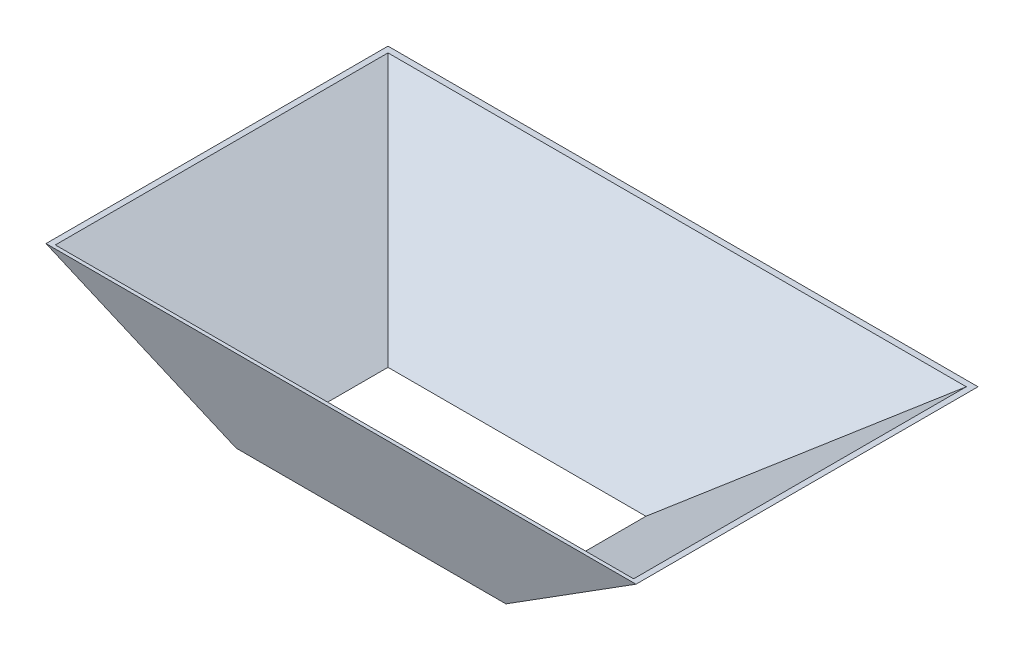
ISO-10303-21;
HEADER;
FILE_DESCRIPTION(('STEP AP214'),'2;1');
FILE_NAME('part.step','',(''),(''),'','','');
FILE_SCHEMA(('AUTOMOTIVE_DESIGN { 1 0 10303 214 1 1 1 1 }'));
ENDSEC;
DATA;
#1=APPLICATION_CONTEXT('core data for automotive mechanical design processes');
#2=APPLICATION_PROTOCOL_DEFINITION('international standard','automotive_design',2000,#1);
#3=PRODUCT_CONTEXT('',#1,'mechanical');
#4=PRODUCT('Part','Part','',(#3));
#5=PRODUCT_RELATED_PRODUCT_CATEGORY('part','',(#4));
#6=PRODUCT_DEFINITION_FORMATION('','',#4);
#7=PRODUCT_DEFINITION_CONTEXT('part definition',#1,'design');
#8=PRODUCT_DEFINITION('design','',#6,#7);
#9=PRODUCT_DEFINITION_SHAPE('','',#8);
#10=(LENGTH_UNIT() NAMED_UNIT(*) SI_UNIT(.MILLI.,.METRE.));
#11=(NAMED_UNIT(*) PLANE_ANGLE_UNIT() SI_UNIT($,.RADIAN.));
#12=(NAMED_UNIT(*) SI_UNIT($,.STERADIAN.) SOLID_ANGLE_UNIT());
#13=UNCERTAINTY_MEASURE_WITH_UNIT(LENGTH_MEASURE(1.E-05),#10,'distance_accuracy_value','');
#14=(GEOMETRIC_REPRESENTATION_CONTEXT(3) GLOBAL_UNCERTAINTY_ASSIGNED_CONTEXT((#13)) GLOBAL_UNIT_ASSIGNED_CONTEXT((#10,
#11,#12)) REPRESENTATION_CONTEXT('',''));
#15=CARTESIAN_POINT('',(0.,0.,0.));
#16=DIRECTION('',(0.,0.,1.));
#17=DIRECTION('',(1.,0.,0.));
#18=AXIS2_PLACEMENT_3D('',#15,#16,#17);
#19=CARTESIAN_POINT('',(0.,0.,0.));
#20=DIRECTION('',(0.,1.,0.));
#21=DIRECTION('',(0.,0.,1.));
#22=AXIS2_PLACEMENT_3D('',#19,#20,#21);
#23=PLANE('',#22);
#24=DIRECTION('',(0.,0.,-1.));
#25=VECTOR('',#24,1.);
#26=CARTESIAN_POINT('',(120.230340386863,0.,0.));
#27=LINE('',#26,#25);
#28=CARTESIAN_POINT('',(120.230340386863,0.,66.6058285412302));
#29=VERTEX_POINT('',#28);
#30=CARTESIAN_POINT('',(120.230340386863,0.,-68.7303403868633));
#31=VERTEX_POINT('',#30);
#32=EDGE_CURVE('E199',#29,#31,#27,.T.);
#33=ORIENTED_EDGE('',*,*,#32,.F.);
#34=DIRECTION('',(1.,0.,0.));
#35=VECTOR('',#34,1.);
#36=CARTESIAN_POINT('',(0.,0.,66.6058285412302));
#37=LINE('',#36,#35);
#38=CARTESIAN_POINT('',(-120.230340386863,0.,66.6058285412302));
#39=VERTEX_POINT('',#38);
#40=EDGE_CURVE('E317',#39,#29,#37,.T.);
#41=ORIENTED_EDGE('',*,*,#40,.F.);
#42=DIRECTION('',(0.,0.,1.));
#43=VECTOR('',#42,1.);
#44=CARTESIAN_POINT('',(-120.230340386863,0.,0.));
#45=LINE('',#44,#43);
#46=CARTESIAN_POINT('',(-120.230340386863,0.,-68.7303403868633));
#47=VERTEX_POINT('',#46);
#48=EDGE_CURVE('E315',#47,#39,#45,.T.);
#49=ORIENTED_EDGE('',*,*,#48,.F.);
#50=DIRECTION('',(-1.,0.,0.));
#51=VECTOR('',#50,1.);
#52=CARTESIAN_POINT('',(0.,0.,-68.7303403868633));
#53=LINE('',#52,#51);
#54=EDGE_CURVE('E301',#31,#47,#53,.T.);
#55=ORIENTED_EDGE('',*,*,#54,.F.);
#56=EDGE_LOOP('',(#33,#41,#49,#55));
#57=FACE_BOUND('',#56,.T.);
#58=DIRECTION('',(0.,0.,-1.));
#59=VECTOR('',#58,1.);
#60=CARTESIAN_POINT('',(115.,0.,-63.5));
#61=LINE('',#60,#59);
#62=CARTESIAN_POINT('',(115.,0.,63.5));
#63=VERTEX_POINT('',#62);
#64=CARTESIAN_POINT('',(115.,0.,-63.5));
#65=VERTEX_POINT('',#64);
#66=EDGE_CURVE('E133',#63,#65,#61,.T.);
#67=ORIENTED_EDGE('',*,*,#66,.T.);
#68=DIRECTION('',(-1.,0.,0.));
#69=VECTOR('',#68,1.);
#70=CARTESIAN_POINT('',(-115.,0.,-63.5));
#71=LINE('',#70,#69);
#72=CARTESIAN_POINT('',(-115.,0.,-63.5));
#73=VERTEX_POINT('',#72);
#74=EDGE_CURVE('E117',#65,#73,#71,.T.);
#75=ORIENTED_EDGE('',*,*,#74,.T.);
#76=DIRECTION('',(0.,0.,1.));
#77=VECTOR('',#76,1.);
#78=CARTESIAN_POINT('',(-115.,0.,-63.5));
#79=LINE('',#78,#77);
#80=CARTESIAN_POINT('',(-115.,0.,63.5));
#81=VERTEX_POINT('',#80);
#82=EDGE_CURVE('E74',#73,#81,#79,.T.);
#83=ORIENTED_EDGE('',*,*,#82,.T.);
#84=DIRECTION('',(1.,0.,0.));
#85=VECTOR('',#84,1.);
#86=CARTESIAN_POINT('',(-115.,0.,63.5));
#87=LINE('',#86,#85);
#88=EDGE_CURVE('E142',#81,#63,#87,.T.);
#89=ORIENTED_EDGE('',*,*,#88,.T.);
#90=EDGE_LOOP('',(#67,#75,#83,#89));
#91=FACE_BOUND('',#90,.T.);
#92=ADVANCED_FACE('F49',(#57,#91),#23,.F.);
#93=CARTESIAN_POINT('',(0.,100.,0.));
#94=DIRECTION('',(0.,1.,0.));
#95=DIRECTION('',(0.,0.,1.));
#96=AXIS2_PLACEMENT_3D('',#93,#94,#95);
#97=PLANE('',#96);
#98=DIRECTION('',(0.,0.,-1.));
#99=VECTOR('',#98,1.);
#100=CARTESIAN_POINT('',(257.814800674213,100.,-206.314800674211));
#101=LINE('',#100,#99);
#102=CARTESIAN_POINT('',(257.814800674213,100.,90.2949192431127));
#103=VERTEX_POINT('',#102);
#104=CARTESIAN_POINT('',(257.814800674213,100.,-206.314800674211));
#105=VERTEX_POINT('',#104);
#106=EDGE_CURVE('E53',#103,#105,#101,.T.);
#107=ORIENTED_EDGE('',*,*,#106,.F.);
#108=DIRECTION('',(1.,0.,0.));
#109=VECTOR('',#108,1.);
#110=CARTESIAN_POINT('',(-257.814800674213,100.,90.2949192431127));
#111=LINE('',#110,#109);
#112=CARTESIAN_POINT('',(-257.814800674213,100.,90.2949192431127));
#113=VERTEX_POINT('',#112);
#114=EDGE_CURVE('E292',#113,#103,#111,.T.);
#115=ORIENTED_EDGE('',*,*,#114,.F.);
#116=DIRECTION('',(0.,0.,1.));
#117=VECTOR('',#116,1.);
#118=CARTESIAN_POINT('',(-257.814800674213,100.,-206.314800674211));
#119=LINE('',#118,#117);
#120=CARTESIAN_POINT('',(-257.814800674213,100.,-206.314800674211));
#121=VERTEX_POINT('',#120);
#122=EDGE_CURVE('E200',#121,#113,#119,.T.);
#123=ORIENTED_EDGE('',*,*,#122,.F.);
#124=DIRECTION('',(-1.,0.,0.));
#125=VECTOR('',#124,1.);
#126=CARTESIAN_POINT('',(-257.814800674213,100.,-206.314800674211));
#127=LINE('',#126,#125);
#128=EDGE_CURVE('E198',#105,#121,#127,.T.);
#129=ORIENTED_EDGE('',*,*,#128,.F.);
#130=EDGE_LOOP('',(#107,#115,#123,#129));
#131=FACE_BOUND('',#130,.T.);
#132=DIRECTION('',(0.,0.,-1.));
#133=VECTOR('',#132,1.);
#134=CARTESIAN_POINT('',(263.045141061076,100.,0.));
#135=LINE('',#134,#133);
#136=CARTESIAN_POINT('',(263.045141061076,100.,93.4007477843429));
#137=VERTEX_POINT('',#136);
#138=CARTESIAN_POINT('',(263.045141061076,100.,-211.545141061074));
#139=VERTEX_POINT('',#138);
#140=EDGE_CURVE('E307',#137,#139,#135,.T.);
#141=ORIENTED_EDGE('',*,*,#140,.T.);
#142=DIRECTION('',(-1.,0.,0.));
#143=VECTOR('',#142,1.);
#144=CARTESIAN_POINT('',(0.,100.,-211.545141061074));
#145=LINE('',#144,#143);
#146=CARTESIAN_POINT('',(-263.045141061076,100.,-211.545141061074));
#147=VERTEX_POINT('',#146);
#148=EDGE_CURVE('E12',#139,#147,#145,.T.);
#149=ORIENTED_EDGE('',*,*,#148,.T.);
#150=DIRECTION('',(0.,0.,1.));
#151=VECTOR('',#150,1.);
#152=CARTESIAN_POINT('',(-263.045141061076,100.,0.));
#153=LINE('',#152,#151);
#154=CARTESIAN_POINT('',(-263.045141061076,100.,93.4007477843429));
#155=VERTEX_POINT('',#154);
#156=EDGE_CURVE('E59',#147,#155,#153,.T.);
#157=ORIENTED_EDGE('',*,*,#156,.T.);
#158=DIRECTION('',(1.,0.,0.));
#159=VECTOR('',#158,1.);
#160=CARTESIAN_POINT('',(0.,100.,93.4007477843429));
#161=LINE('',#160,#159);
#162=EDGE_CURVE('E311',#155,#137,#161,.T.);
#163=ORIENTED_EDGE('',*,*,#162,.T.);
#164=EDGE_LOOP('',(#141,#149,#157,#163));
#165=FACE_BOUND('',#164,.T.);
#166=ADVANCED_FACE('F164',(#131,#165),#97,.T.);
#167=CARTESIAN_POINT('',(-39.5545710678266,-56.4897818280565,0.));
#168=DIRECTION('',(0.573576436351042,0.819152044288995,0.));
#169=DIRECTION('',(-0.819152044288995,0.573576436351042,0.));
#170=AXIS2_PLACEMENT_3D('',#167,#168,#169);
#171=PLANE('',#170);
#172=DIRECTION('',(-0.809645768037903,0.566920070059723,0.151905774945501));
#173=VECTOR('',#172,1.);
#174=CARTESIAN_POINT('',(-33.2243517994289,-60.9222490783089,50.2817610996094));
#175=LINE('',#174,#173);
#176=EDGE_CURVE('E297',#39,#155,#175,.T.);
#177=ORIENTED_EDGE('',*,*,#176,.T.);
#178=ORIENTED_EDGE('',*,*,#156,.F.);
#179=DIRECTION('',(-0.633687274224647,0.443712606279656,-0.633687274224638));
#180=VECTOR('',#179,1.);
#181=CARTESIAN_POINT('',(-44.3513722719294,-53.1310254656503,7.1486277280695));
#182=LINE('',#181,#180);
#183=EDGE_CURVE('E300',#47,#147,#182,.T.);
#184=ORIENTED_EDGE('',*,*,#183,.F.);
#185=ORIENTED_EDGE('',*,*,#48,.T.);
#186=EDGE_LOOP('',(#177,#178,#184,#185));
#187=FACE_BOUND('',#186,.T.);
#188=ADVANCED_FACE('F337',(#187),#171,.F.);
#189=CARTESIAN_POINT('',(0.,-32.2926968428196,-22.6115897584633));
#190=DIRECTION('',(0.,-0.819152044288991,-0.573576436351047));
#191=DIRECTION('',(0.,0.573576436351047,-0.819152044288991));
#192=AXIS2_PLACEMENT_3D('',#189,#190,#191);
#193=PLANE('',#192);
#194=ORIENTED_EDGE('',*,*,#183,.T.);
#195=ORIENTED_EDGE('',*,*,#148,.F.);
#196=DIRECTION('',(0.633687274224647,0.443712606279656,-0.633687274224638));
#197=VECTOR('',#196,1.);
#198=CARTESIAN_POINT('',(44.3513722719294,-53.1310254656503,7.1486277280695));
#199=LINE('',#198,#197);
#200=EDGE_CURVE('E305',#31,#139,#199,.T.);
#201=ORIENTED_EDGE('',*,*,#200,.F.);
#202=ORIENTED_EDGE('',*,*,#54,.T.);
#203=EDGE_LOOP('',(#194,#195,#201,#202));
#204=FACE_BOUND('',#203,.T.);
#205=ADVANCED_FACE('F333',(#204),#193,.T.);
#206=CARTESIAN_POINT('',(0.,-16.6514571353078,62.144084049023));
#207=DIRECTION('',(0.,-0.258819045102525,0.965925826289067));
#208=DIRECTION('',(0.,-0.965925826289067,-0.258819045102525));
#209=AXIS2_PLACEMENT_3D('',#206,#207,#208);
#210=PLANE('',#209);
#211=DIRECTION('',(0.809645768037903,0.566920070059723,0.151905774945501));
#212=VECTOR('',#211,1.);
#213=CARTESIAN_POINT('',(33.2243517994289,-60.9222490783089,50.2817610996094));
#214=LINE('',#213,#212);
#215=EDGE_CURVE('E304',#29,#137,#214,.T.);
#216=ORIENTED_EDGE('',*,*,#215,.T.);
#217=ORIENTED_EDGE('',*,*,#162,.F.);
#218=ORIENTED_EDGE('',*,*,#176,.F.);
#219=ORIENTED_EDGE('',*,*,#40,.T.);
#220=EDGE_LOOP('',(#216,#217,#218,#219));
#221=FACE_BOUND('',#220,.T.);
#222=ADVANCED_FACE('F325',(#221),#210,.T.);
#223=CARTESIAN_POINT('',(39.5545710678266,-56.4897818280565,0.));
#224=DIRECTION('',(-0.573576436351042,0.819152044288995,0.));
#225=DIRECTION('',(-0.819152044288995,-0.573576436351042,0.));
#226=AXIS2_PLACEMENT_3D('',#223,#224,#225);
#227=PLANE('',#226);
#228=ORIENTED_EDGE('',*,*,#200,.T.);
#229=ORIENTED_EDGE('',*,*,#140,.F.);
#230=ORIENTED_EDGE('',*,*,#215,.F.);
#231=ORIENTED_EDGE('',*,*,#32,.T.);
#232=EDGE_LOOP('',(#228,#229,#230,#231));
#233=FACE_BOUND('',#232,.T.);
#234=ADVANCED_FACE('F51',(#233),#227,.F.);
#235=CARTESIAN_POINT('',(-37.8338417587735,-54.0323256951895,0.));
#236=DIRECTION('',(0.573576436351042,0.819152044288995,0.));
#237=DIRECTION('',(-0.819152044288995,0.573576436351042,0.));
#238=AXIS2_PLACEMENT_3D('',#235,#236,#237);
#239=PLANE('',#238);
#240=DIRECTION('',(-0.809645768037903,0.566920070059723,0.151905774945501));
#241=VECTOR('',#240,1.);
#242=CARTESIAN_POINT('',(-115.,0.,63.5));
#243=LINE('',#242,#241);
#244=EDGE_CURVE('E67',#81,#113,#243,.T.);
#245=ORIENTED_EDGE('',*,*,#244,.F.);
#246=ORIENTED_EDGE('',*,*,#82,.F.);
#247=DIRECTION('',(-0.633687274224647,0.443712606279656,-0.633687274224638));
#248=VECTOR('',#247,1.);
#249=CARTESIAN_POINT('',(-115.,0.,-63.5));
#250=LINE('',#249,#248);
#251=EDGE_CURVE('E123',#73,#121,#250,.T.);
#252=ORIENTED_EDGE('',*,*,#251,.T.);
#253=ORIENTED_EDGE('',*,*,#122,.T.);
#254=EDGE_LOOP('',(#245,#246,#252,#253));
#255=FACE_BOUND('',#254,.T.);
#256=ADVANCED_FACE('F232',(#255),#239,.T.);
#257=CARTESIAN_POINT('',(0.,-29.8352407099526,-20.8908604494101));
#258=DIRECTION('',(0.,-0.819152044288991,-0.573576436351047));
#259=DIRECTION('',(0.,0.573576436351047,-0.819152044288991));
#260=AXIS2_PLACEMENT_3D('',#257,#258,#259);
#261=PLANE('',#260);
#262=ORIENTED_EDGE('',*,*,#251,.F.);
#263=ORIENTED_EDGE('',*,*,#74,.F.);
#264=DIRECTION('',(0.633687274224647,0.443712606279656,-0.633687274224638));
#265=VECTOR('',#264,1.);
#266=CARTESIAN_POINT('',(115.,0.,-63.5));
#267=LINE('',#266,#265);
#268=EDGE_CURVE('E121',#65,#105,#267,.T.);
#269=ORIENTED_EDGE('',*,*,#268,.T.);
#270=ORIENTED_EDGE('',*,*,#128,.T.);
#271=EDGE_LOOP('',(#262,#263,#269,#270));
#272=FACE_BOUND('',#271,.T.);
#273=ADVANCED_FACE('F120',(#272),#261,.F.);
#274=CARTESIAN_POINT('',(0.,-15.8750000000002,59.2463065701558));
#275=DIRECTION('',(0.,-0.258819045102525,0.965925826289067));
#276=DIRECTION('',(0.,-0.965925826289067,-0.258819045102525));
#277=AXIS2_PLACEMENT_3D('',#274,#275,#276);
#278=PLANE('',#277);
#279=DIRECTION('',(0.809645768037903,0.566920070059723,0.151905774945501));
#280=VECTOR('',#279,1.);
#281=CARTESIAN_POINT('',(115.,0.,63.5));
#282=LINE('',#281,#280);
#283=EDGE_CURVE('E139',#63,#103,#282,.T.);
#284=ORIENTED_EDGE('',*,*,#283,.F.);
#285=ORIENTED_EDGE('',*,*,#88,.F.);
#286=ORIENTED_EDGE('',*,*,#244,.T.);
#287=ORIENTED_EDGE('',*,*,#114,.T.);
#288=EDGE_LOOP('',(#284,#285,#286,#287));
#289=FACE_BOUND('',#288,.T.);
#290=ADVANCED_FACE('F279',(#289),#278,.F.);
#291=CARTESIAN_POINT('',(37.8338417587735,-54.0323256951895,0.));
#292=DIRECTION('',(-0.573576436351042,0.819152044288995,0.));
#293=DIRECTION('',(-0.819152044288995,-0.573576436351042,0.));
#294=AXIS2_PLACEMENT_3D('',#291,#292,#293);
#295=PLANE('',#294);
#296=ORIENTED_EDGE('',*,*,#268,.F.);
#297=ORIENTED_EDGE('',*,*,#66,.F.);
#298=ORIENTED_EDGE('',*,*,#283,.T.);
#299=ORIENTED_EDGE('',*,*,#106,.T.);
#300=EDGE_LOOP('',(#296,#297,#298,#299));
#301=FACE_BOUND('',#300,.T.);
#302=ADVANCED_FACE('F131',(#301),#295,.T.);
#303=CLOSED_SHELL('',(#92,#166,#188,#205,#222,#234,#256,#273,#290,#302));
#304=MANIFOLD_SOLID_BREP('B2',#303);
#305=ADVANCED_BREP_SHAPE_REPRESENTATION('',(#18,#304),#14);
#306=SHAPE_DEFINITION_REPRESENTATION(#9,#305);
ENDSEC;
END-ISO-10303-21;
